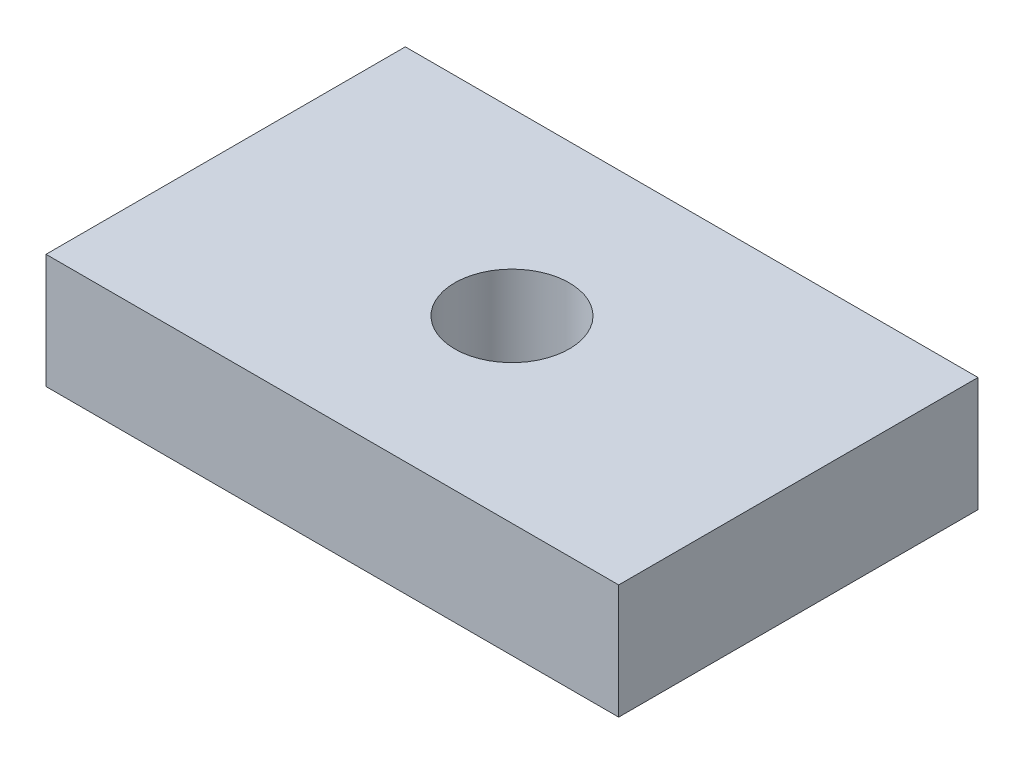
ISO-10303-21;
HEADER;
FILE_DESCRIPTION(('STEP AP214'),'2;1');
FILE_NAME('part.step','',(''),(''),'','','');
FILE_SCHEMA(('AUTOMOTIVE_DESIGN { 1 0 10303 214 1 1 1 1 }'));
ENDSEC;
DATA;
#1=APPLICATION_CONTEXT('core data for automotive mechanical design processes');
#2=APPLICATION_PROTOCOL_DEFINITION('international standard','automotive_design',2000,#1);
#3=PRODUCT_CONTEXT('',#1,'mechanical');
#4=PRODUCT('Part','Part','',(#3));
#5=PRODUCT_RELATED_PRODUCT_CATEGORY('part','',(#4));
#6=PRODUCT_DEFINITION_FORMATION('','',#4);
#7=PRODUCT_DEFINITION_CONTEXT('part definition',#1,'design');
#8=PRODUCT_DEFINITION('design','',#6,#7);
#9=PRODUCT_DEFINITION_SHAPE('','',#8);
#10=(LENGTH_UNIT() NAMED_UNIT(*) SI_UNIT(.MILLI.,.METRE.));
#11=(NAMED_UNIT(*) PLANE_ANGLE_UNIT() SI_UNIT($,.RADIAN.));
#12=(NAMED_UNIT(*) SI_UNIT($,.STERADIAN.) SOLID_ANGLE_UNIT());
#13=UNCERTAINTY_MEASURE_WITH_UNIT(LENGTH_MEASURE(1.E-05),#10,'distance_accuracy_value','');
#14=(GEOMETRIC_REPRESENTATION_CONTEXT(3) GLOBAL_UNCERTAINTY_ASSIGNED_CONTEXT((#13)) GLOBAL_UNIT_ASSIGNED_CONTEXT((#10,
#11,#12)) REPRESENTATION_CONTEXT('',''));
#15=CARTESIAN_POINT('',(0.,0.,0.));
#16=DIRECTION('',(0.,0.,1.));
#17=DIRECTION('',(1.,0.,0.));
#18=AXIS2_PLACEMENT_3D('',#15,#16,#17);
#19=CARTESIAN_POINT('',(0.,10.,0.));
#20=DIRECTION('',(0.,-1.,0.));
#21=DIRECTION('',(0.,0.,-1.));
#22=AXIS2_PLACEMENT_3D('',#19,#20,#21);
#23=PLANE('',#22);
#24=DIRECTION('',(0.,0.,1.));
#25=VECTOR('',#24,1.);
#26=CARTESIAN_POINT('',(0.,10.,0.));
#27=LINE('',#26,#25);
#28=CARTESIAN_POINT('',(0.,10.,-31.3720056262062));
#29=VERTEX_POINT('',#28);
#30=CARTESIAN_POINT('',(0.,10.,0.));
#31=VERTEX_POINT('',#30);
#32=EDGE_CURVE('E87',#29,#31,#27,.T.);
#33=ORIENTED_EDGE('',*,*,#32,.T.);
#34=DIRECTION('',(1.,0.,0.));
#35=VECTOR('',#34,1.);
#36=CARTESIAN_POINT('',(0.,10.,0.));
#37=LINE('',#36,#35);
#38=CARTESIAN_POINT('',(50.,10.,0.));
#39=VERTEX_POINT('',#38);
#40=EDGE_CURVE('E82',#31,#39,#37,.T.);
#41=ORIENTED_EDGE('',*,*,#40,.T.);
#42=DIRECTION('',(0.,0.,-1.));
#43=VECTOR('',#42,1.);
#44=CARTESIAN_POINT('',(50.,10.,0.));
#45=LINE('',#44,#43);
#46=CARTESIAN_POINT('',(50.,10.,-31.3720056262062));
#47=VERTEX_POINT('',#46);
#48=EDGE_CURVE('E85',#39,#47,#45,.T.);
#49=ORIENTED_EDGE('',*,*,#48,.T.);
#50=DIRECTION('',(-1.,0.,0.));
#51=VECTOR('',#50,1.);
#52=CARTESIAN_POINT('',(0.,10.,-31.3720056262062));
#53=LINE('',#52,#51);
#54=EDGE_CURVE('E52',#47,#29,#53,.T.);
#55=ORIENTED_EDGE('',*,*,#54,.T.);
#56=EDGE_LOOP('',(#33,#41,#49,#55));
#57=FACE_BOUND('',#56,.T.);
#58=CARTESIAN_POINT('',(25.,10.,-15.6860028131031));
#59=DIRECTION('',(0.,1.,0.));
#60=DIRECTION('',(0.,0.,1.));
#61=AXIS2_PLACEMENT_3D('',#58,#59,#60);
#62=CIRCLE('',#61,5.0025);
#63=CARTESIAN_POINT('',(25.,10.,-10.6835028131031));
#64=VERTEX_POINT('',#63);
#65=EDGE_CURVE('E102',#64,#64,#62,.T.);
#66=ORIENTED_EDGE('',*,*,#65,.F.);
#67=EDGE_LOOP('',(#66));
#68=FACE_BOUND('',#67,.T.);
#69=ADVANCED_FACE('F35',(#57,#68),#23,.F.);
#70=CARTESIAN_POINT('',(0.,0.,0.));
#71=DIRECTION('',(0.,-1.,0.));
#72=DIRECTION('',(0.,0.,-1.));
#73=AXIS2_PLACEMENT_3D('',#70,#71,#72);
#74=PLANE('',#73);
#75=DIRECTION('',(0.,0.,1.));
#76=VECTOR('',#75,1.);
#77=CARTESIAN_POINT('',(0.,0.,0.));
#78=LINE('',#77,#76);
#79=CARTESIAN_POINT('',(0.,0.,-31.3720056262062));
#80=VERTEX_POINT('',#79);
#81=CARTESIAN_POINT('',(0.,0.,0.));
#82=VERTEX_POINT('',#81);
#83=EDGE_CURVE('E99',#80,#82,#78,.T.);
#84=ORIENTED_EDGE('',*,*,#83,.F.);
#85=DIRECTION('',(-1.,0.,0.));
#86=VECTOR('',#85,1.);
#87=CARTESIAN_POINT('',(0.,0.,-31.3720056262062));
#88=LINE('',#87,#86);
#89=CARTESIAN_POINT('',(50.,0.,-31.3720056262062));
#90=VERTEX_POINT('',#89);
#91=EDGE_CURVE('E75',#90,#80,#88,.T.);
#92=ORIENTED_EDGE('',*,*,#91,.F.);
#93=DIRECTION('',(0.,0.,-1.));
#94=VECTOR('',#93,1.);
#95=CARTESIAN_POINT('',(50.,0.,0.));
#96=LINE('',#95,#94);
#97=CARTESIAN_POINT('',(50.,0.,0.));
#98=VERTEX_POINT('',#97);
#99=EDGE_CURVE('E69',#98,#90,#96,.T.);
#100=ORIENTED_EDGE('',*,*,#99,.F.);
#101=DIRECTION('',(1.,0.,0.));
#102=VECTOR('',#101,1.);
#103=CARTESIAN_POINT('',(0.,0.,0.));
#104=LINE('',#103,#102);
#105=EDGE_CURVE('E91',#82,#98,#104,.T.);
#106=ORIENTED_EDGE('',*,*,#105,.F.);
#107=EDGE_LOOP('',(#84,#92,#100,#106));
#108=FACE_BOUND('',#107,.T.);
#109=CARTESIAN_POINT('',(25.,0.,-15.6860028131031));
#110=DIRECTION('',(0.,1.,0.));
#111=DIRECTION('',(0.,0.,1.));
#112=AXIS2_PLACEMENT_3D('',#109,#110,#111);
#113=CIRCLE('',#112,5.0025);
#114=CARTESIAN_POINT('',(25.,0.,-10.6835028131031));
#115=VERTEX_POINT('',#114);
#116=EDGE_CURVE('E114',#115,#115,#113,.T.);
#117=ORIENTED_EDGE('',*,*,#116,.T.);
#118=EDGE_LOOP('',(#117));
#119=FACE_BOUND('',#118,.T.);
#120=ADVANCED_FACE('F110',(#108,#119),#74,.T.);
#121=CARTESIAN_POINT('',(0.,10.,0.));
#122=DIRECTION('',(1.,0.,0.));
#123=DIRECTION('',(0.,0.,-1.));
#124=AXIS2_PLACEMENT_3D('',#121,#122,#123);
#125=PLANE('',#124);
#126=ORIENTED_EDGE('',*,*,#83,.T.);
#127=DIRECTION('',(0.,-1.,0.));
#128=VECTOR('',#127,1.);
#129=CARTESIAN_POINT('',(0.,10.,0.));
#130=LINE('',#129,#128);
#131=EDGE_CURVE('E11',#31,#82,#130,.T.);
#132=ORIENTED_EDGE('',*,*,#131,.F.);
#133=ORIENTED_EDGE('',*,*,#32,.F.);
#134=DIRECTION('',(0.,-1.,0.));
#135=VECTOR('',#134,1.);
#136=CARTESIAN_POINT('',(0.,10.,-31.3720056262062));
#137=LINE('',#136,#135);
#138=EDGE_CURVE('E95',#29,#80,#137,.T.);
#139=ORIENTED_EDGE('',*,*,#138,.T.);
#140=EDGE_LOOP('',(#126,#132,#133,#139));
#141=FACE_BOUND('',#140,.T.);
#142=ADVANCED_FACE('F37',(#141),#125,.F.);
#143=CARTESIAN_POINT('',(0.,10.,0.));
#144=DIRECTION('',(0.,0.,-1.));
#145=DIRECTION('',(-1.,0.,0.));
#146=AXIS2_PLACEMENT_3D('',#143,#144,#145);
#147=PLANE('',#146);
#148=ORIENTED_EDGE('',*,*,#105,.T.);
#149=DIRECTION('',(0.,-1.,0.));
#150=VECTOR('',#149,1.);
#151=CARTESIAN_POINT('',(50.,10.,0.));
#152=LINE('',#151,#150);
#153=EDGE_CURVE('E44',#39,#98,#152,.T.);
#154=ORIENTED_EDGE('',*,*,#153,.F.);
#155=ORIENTED_EDGE('',*,*,#40,.F.);
#156=ORIENTED_EDGE('',*,*,#131,.T.);
#157=EDGE_LOOP('',(#148,#154,#155,#156));
#158=FACE_BOUND('',#157,.T.);
#159=ADVANCED_FACE('F90',(#158),#147,.F.);
#160=CARTESIAN_POINT('',(50.,10.,0.));
#161=DIRECTION('',(-1.,0.,0.));
#162=DIRECTION('',(0.,0.,1.));
#163=AXIS2_PLACEMENT_3D('',#160,#161,#162);
#164=PLANE('',#163);
#165=ORIENTED_EDGE('',*,*,#99,.T.);
#166=DIRECTION('',(0.,-1.,0.));
#167=VECTOR('',#166,1.);
#168=CARTESIAN_POINT('',(50.,10.,-31.3720056262062));
#169=LINE('',#168,#167);
#170=EDGE_CURVE('E92',#47,#90,#169,.T.);
#171=ORIENTED_EDGE('',*,*,#170,.F.);
#172=ORIENTED_EDGE('',*,*,#48,.F.);
#173=ORIENTED_EDGE('',*,*,#153,.T.);
#174=EDGE_LOOP('',(#165,#171,#172,#173));
#175=FACE_BOUND('',#174,.T.);
#176=ADVANCED_FACE('F93',(#175),#164,.F.);
#177=CARTESIAN_POINT('',(0.,10.,-31.3720056262062));
#178=DIRECTION('',(0.,0.,1.));
#179=DIRECTION('',(1.,0.,0.));
#180=AXIS2_PLACEMENT_3D('',#177,#178,#179);
#181=PLANE('',#180);
#182=ORIENTED_EDGE('',*,*,#91,.T.);
#183=ORIENTED_EDGE('',*,*,#138,.F.);
#184=ORIENTED_EDGE('',*,*,#54,.F.);
#185=ORIENTED_EDGE('',*,*,#170,.T.);
#186=EDGE_LOOP('',(#182,#183,#184,#185));
#187=FACE_BOUND('',#186,.T.);
#188=ADVANCED_FACE('F107',(#187),#181,.F.);
#189=CARTESIAN_POINT('',(25.,10.,-15.6860028131031));
#190=DIRECTION('',(0.,-1.,0.));
#191=DIRECTION('',(0.,0.,-1.));
#192=AXIS2_PLACEMENT_3D('',#189,#190,#191);
#193=CYLINDRICAL_SURFACE('',#192,5.0025);
#194=ORIENTED_EDGE('',*,*,#65,.T.);
#195=EDGE_LOOP('',(#194));
#196=FACE_BOUND('',#195,.T.);
#197=ORIENTED_EDGE('',*,*,#116,.F.);
#198=EDGE_LOOP('',(#197));
#199=FACE_BOUND('',#198,.T.);
#200=ADVANCED_FACE('F120',(#196,#199),#193,.F.);
#201=CLOSED_SHELL('',(#69,#120,#142,#159,#176,#188,#200));
#202=MANIFOLD_SOLID_BREP('B2',#201);
#203=ADVANCED_BREP_SHAPE_REPRESENTATION('',(#18,#202),#14);
#204=SHAPE_DEFINITION_REPRESENTATION(#9,#203);
ENDSEC;
END-ISO-10303-21;
